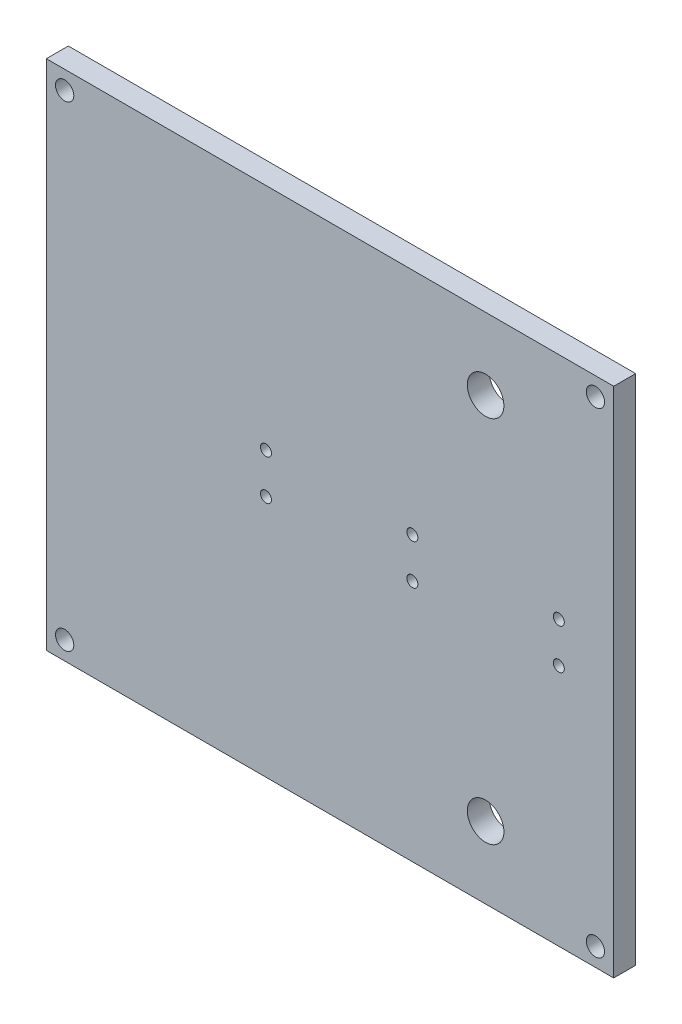
ISO-10303-21;
HEADER;
FILE_DESCRIPTION(('STEP AP214'),'2;1');
FILE_NAME('part.step','',(''),(''),'','','');
FILE_SCHEMA(('AUTOMOTIVE_DESIGN { 1 0 10303 214 1 1 1 1 }'));
ENDSEC;
DATA;
#1=APPLICATION_CONTEXT('core data for automotive mechanical design processes');
#2=APPLICATION_PROTOCOL_DEFINITION('international standard','automotive_design',2000,#1);
#3=PRODUCT_CONTEXT('',#1,'mechanical');
#4=PRODUCT('Part','Part','',(#3));
#5=PRODUCT_RELATED_PRODUCT_CATEGORY('part','',(#4));
#6=PRODUCT_DEFINITION_FORMATION('','',#4);
#7=PRODUCT_DEFINITION_CONTEXT('part definition',#1,'design');
#8=PRODUCT_DEFINITION('design','',#6,#7);
#9=PRODUCT_DEFINITION_SHAPE('','',#8);
#10=(LENGTH_UNIT() NAMED_UNIT(*) SI_UNIT(.MILLI.,.METRE.));
#11=(NAMED_UNIT(*) PLANE_ANGLE_UNIT() SI_UNIT($,.RADIAN.));
#12=(NAMED_UNIT(*) SI_UNIT($,.STERADIAN.) SOLID_ANGLE_UNIT());
#13=UNCERTAINTY_MEASURE_WITH_UNIT(LENGTH_MEASURE(1.E-05),#10,'distance_accuracy_value','');
#14=(GEOMETRIC_REPRESENTATION_CONTEXT(3) GLOBAL_UNCERTAINTY_ASSIGNED_CONTEXT((#13)) GLOBAL_UNIT_ASSIGNED_CONTEXT((#10,
#11,#12)) REPRESENTATION_CONTEXT('',''));
#15=CARTESIAN_POINT('',(0.,0.,0.));
#16=DIRECTION('',(0.,0.,1.));
#17=DIRECTION('',(1.,0.,0.));
#18=AXIS2_PLACEMENT_3D('',#15,#16,#17);
#19=CARTESIAN_POINT('',(0.,0.,6.));
#20=DIRECTION('',(0.,0.,1.));
#21=DIRECTION('',(1.,0.,0.));
#22=AXIS2_PLACEMENT_3D('',#19,#20,#21);
#23=PLANE('',#22);
#24=CARTESIAN_POINT('',(-17.5,1.87499999999996,6.));
#25=DIRECTION('',(0.,0.,1.));
#26=DIRECTION('',(1.,0.,0.));
#27=AXIS2_PLACEMENT_3D('',#24,#25,#26);
#28=CIRCLE('',#27,1.5);
#29=CARTESIAN_POINT('',(-16.,1.87499999999996,6.));
#30=VERTEX_POINT('',#29);
#31=EDGE_CURVE('E178',#30,#30,#28,.T.);
#32=ORIENTED_EDGE('',*,*,#31,.F.);
#33=EDGE_LOOP('',(#32));
#34=FACE_BOUND('',#33,.T.);
#35=CARTESIAN_POINT('',(22.5,1.87499999999996,6.));
#36=DIRECTION('',(0.,0.,1.));
#37=DIRECTION('',(1.,0.,0.));
#38=AXIS2_PLACEMENT_3D('',#35,#36,#37);
#39=CIRCLE('',#38,1.5);
#40=CARTESIAN_POINT('',(24.,1.87499999999996,6.));
#41=VERTEX_POINT('',#40);
#42=EDGE_CURVE('E172',#41,#41,#39,.T.);
#43=ORIENTED_EDGE('',*,*,#42,.F.);
#44=EDGE_LOOP('',(#43));
#45=FACE_BOUND('',#44,.T.);
#46=CARTESIAN_POINT('',(62.5,1.87499999999996,6.));
#47=DIRECTION('',(0.,0.,1.));
#48=DIRECTION('',(1.,0.,0.));
#49=AXIS2_PLACEMENT_3D('',#46,#47,#48);
#50=CIRCLE('',#49,1.5);
#51=CARTESIAN_POINT('',(64.,1.87499999999996,6.));
#52=VERTEX_POINT('',#51);
#53=EDGE_CURVE('E166',#52,#52,#50,.T.);
#54=ORIENTED_EDGE('',*,*,#53,.F.);
#55=EDGE_LOOP('',(#54));
#56=FACE_BOUND('',#55,.T.);
#57=CARTESIAN_POINT('',(62.5,12.875,6.));
#58=DIRECTION('',(0.,0.,1.));
#59=DIRECTION('',(1.,0.,0.));
#60=AXIS2_PLACEMENT_3D('',#57,#58,#59);
#61=CIRCLE('',#60,1.5);
#62=CARTESIAN_POINT('',(64.,12.875,6.));
#63=VERTEX_POINT('',#62);
#64=EDGE_CURVE('E160',#63,#63,#61,.T.);
#65=ORIENTED_EDGE('',*,*,#64,.F.);
#66=EDGE_LOOP('',(#65));
#67=FACE_BOUND('',#66,.T.);
#68=CARTESIAN_POINT('',(22.5,12.875,6.));
#69=DIRECTION('',(0.,0.,1.));
#70=DIRECTION('',(1.,0.,0.));
#71=AXIS2_PLACEMENT_3D('',#68,#69,#70);
#72=CIRCLE('',#71,1.5);
#73=CARTESIAN_POINT('',(24.,12.875,6.));
#74=VERTEX_POINT('',#73);
#75=EDGE_CURVE('E154',#74,#74,#72,.T.);
#76=ORIENTED_EDGE('',*,*,#75,.F.);
#77=EDGE_LOOP('',(#76));
#78=FACE_BOUND('',#77,.T.);
#79=CARTESIAN_POINT('',(-17.5,12.875,6.));
#80=DIRECTION('',(0.,0.,1.));
#81=DIRECTION('',(1.,0.,0.));
#82=AXIS2_PLACEMENT_3D('',#79,#80,#81);
#83=CIRCLE('',#82,1.5);
#84=CARTESIAN_POINT('',(-16.,12.875,6.));
#85=VERTEX_POINT('',#84);
#86=EDGE_CURVE('E148',#85,#85,#83,.T.);
#87=ORIENTED_EDGE('',*,*,#86,.F.);
#88=EDGE_LOOP('',(#87));
#89=FACE_BOUND('',#88,.T.);
#90=CARTESIAN_POINT('',(72.5,-59.5,6.));
#91=DIRECTION('',(0.,0.,1.));
#92=DIRECTION('',(-1.,0.,0.));
#93=AXIS2_PLACEMENT_3D('',#90,#91,#92);
#94=CIRCLE('',#93,2.50000000000001);
#95=CARTESIAN_POINT('',(70.,-59.5,6.));
#96=VERTEX_POINT('',#95);
#97=EDGE_CURVE('E133',#96,#96,#94,.T.);
#98=ORIENTED_EDGE('',*,*,#97,.F.);
#99=EDGE_LOOP('',(#98));
#100=FACE_BOUND('',#99,.T.);
#101=CARTESIAN_POINT('',(-72.5,-59.5,6.));
#102=DIRECTION('',(0.,0.,1.));
#103=DIRECTION('',(1.,0.,0.));
#104=AXIS2_PLACEMENT_3D('',#101,#102,#103);
#105=CIRCLE('',#104,2.50000000000001);
#106=CARTESIAN_POINT('',(-70.,-59.5,6.));
#107=VERTEX_POINT('',#106);
#108=EDGE_CURVE('E121',#107,#107,#105,.T.);
#109=ORIENTED_EDGE('',*,*,#108,.F.);
#110=EDGE_LOOP('',(#109));
#111=FACE_BOUND('',#110,.T.);
#112=CARTESIAN_POINT('',(42.5,-44.9,6.));
#113=DIRECTION('',(0.,0.,1.));
#114=DIRECTION('',(1.,0.,0.));
#115=AXIS2_PLACEMENT_3D('',#112,#113,#114);
#116=CIRCLE('',#115,5.);
#117=CARTESIAN_POINT('',(47.5,-44.9,6.));
#118=VERTEX_POINT('',#117);
#119=EDGE_CURVE('E100',#118,#118,#116,.T.);
#120=ORIENTED_EDGE('',*,*,#119,.F.);
#121=EDGE_LOOP('',(#120));
#122=FACE_BOUND('',#121,.T.);
#123=DIRECTION('',(0.,-1.,0.));
#124=VECTOR('',#123,1.);
#125=CARTESIAN_POINT('',(-77.5,75.5,6.));
#126=LINE('',#125,#124);
#127=CARTESIAN_POINT('',(-77.5,75.5,6.));
#128=VERTEX_POINT('',#127);
#129=CARTESIAN_POINT('',(-77.5,-64.5,6.));
#130=VERTEX_POINT('',#129);
#131=EDGE_CURVE('E85',#128,#130,#126,.T.);
#132=ORIENTED_EDGE('',*,*,#131,.T.);
#133=DIRECTION('',(1.,0.,0.));
#134=VECTOR('',#133,1.);
#135=CARTESIAN_POINT('',(-77.5,-64.5,6.));
#136=LINE('',#135,#134);
#137=CARTESIAN_POINT('',(77.5,-64.5000000000001,6.));
#138=VERTEX_POINT('',#137);
#139=EDGE_CURVE('E80',#130,#138,#136,.T.);
#140=ORIENTED_EDGE('',*,*,#139,.T.);
#141=DIRECTION('',(0.,1.,0.));
#142=VECTOR('',#141,1.);
#143=CARTESIAN_POINT('',(77.5,75.5,6.));
#144=LINE('',#143,#142);
#145=CARTESIAN_POINT('',(77.5,75.5,6.));
#146=VERTEX_POINT('',#145);
#147=EDGE_CURVE('E83',#138,#146,#144,.T.);
#148=ORIENTED_EDGE('',*,*,#147,.T.);
#149=DIRECTION('',(-1.,0.,0.));
#150=VECTOR('',#149,1.);
#151=CARTESIAN_POINT('',(-77.5,75.5,6.));
#152=LINE('',#151,#150);
#153=EDGE_CURVE('E50',#146,#128,#152,.T.);
#154=ORIENTED_EDGE('',*,*,#153,.T.);
#155=EDGE_LOOP('',(#132,#140,#148,#154));
#156=FACE_BOUND('',#155,.T.);
#157=CARTESIAN_POINT('',(42.5,55.875,6.));
#158=DIRECTION('',(0.,0.,1.));
#159=DIRECTION('',(-1.,0.,0.));
#160=AXIS2_PLACEMENT_3D('',#157,#158,#159);
#161=CIRCLE('',#160,4.99999999999999);
#162=CARTESIAN_POINT('',(37.5,55.875,6.));
#163=VERTEX_POINT('',#162);
#164=EDGE_CURVE('E115',#163,#163,#161,.T.);
#165=ORIENTED_EDGE('',*,*,#164,.F.);
#166=EDGE_LOOP('',(#165));
#167=FACE_BOUND('',#166,.T.);
#168=CARTESIAN_POINT('',(-72.5,70.5,6.));
#169=DIRECTION('',(0.,0.,1.));
#170=DIRECTION('',(-1.,0.,0.));
#171=AXIS2_PLACEMENT_3D('',#168,#169,#170);
#172=CIRCLE('',#171,2.50000000000001);
#173=CARTESIAN_POINT('',(-75.,70.5,6.));
#174=VERTEX_POINT('',#173);
#175=EDGE_CURVE('E127',#174,#174,#172,.T.);
#176=ORIENTED_EDGE('',*,*,#175,.F.);
#177=EDGE_LOOP('',(#176));
#178=FACE_BOUND('',#177,.T.);
#179=CARTESIAN_POINT('',(72.5,70.5,6.));
#180=DIRECTION('',(0.,0.,1.));
#181=DIRECTION('',(1.,0.,0.));
#182=AXIS2_PLACEMENT_3D('',#179,#180,#181);
#183=CIRCLE('',#182,2.50000000000001);
#184=CARTESIAN_POINT('',(75.,70.5,6.));
#185=VERTEX_POINT('',#184);
#186=EDGE_CURVE('E139',#185,#185,#183,.T.);
#187=ORIENTED_EDGE('',*,*,#186,.F.);
#188=EDGE_LOOP('',(#187));
#189=FACE_BOUND('',#188,.T.);
#190=ADVANCED_FACE('F33',(#34,#45,#56,#67,#78,#89,#100,#111,#122,#156,#167,#178,#189),#23,.T.);
#191=CARTESIAN_POINT('',(0.,0.,0.));
#192=DIRECTION('',(0.,0.,1.));
#193=DIRECTION('',(1.,0.,0.));
#194=AXIS2_PLACEMENT_3D('',#191,#192,#193);
#195=PLANE('',#194);
#196=CARTESIAN_POINT('',(-17.5,1.87499999999996,0.));
#197=DIRECTION('',(0.,0.,1.));
#198=DIRECTION('',(1.,0.,0.));
#199=AXIS2_PLACEMENT_3D('',#196,#197,#198);
#200=CIRCLE('',#199,1.5);
#201=CARTESIAN_POINT('',(-16.,1.87499999999996,0.));
#202=VERTEX_POINT('',#201);
#203=EDGE_CURVE('E175',#202,#202,#200,.T.);
#204=ORIENTED_EDGE('',*,*,#203,.T.);
#205=EDGE_LOOP('',(#204));
#206=FACE_BOUND('',#205,.T.);
#207=CARTESIAN_POINT('',(22.5,1.87499999999996,0.));
#208=DIRECTION('',(0.,0.,1.));
#209=DIRECTION('',(1.,0.,0.));
#210=AXIS2_PLACEMENT_3D('',#207,#208,#209);
#211=CIRCLE('',#210,1.5);
#212=CARTESIAN_POINT('',(24.,1.87499999999996,0.));
#213=VERTEX_POINT('',#212);
#214=EDGE_CURVE('E169',#213,#213,#211,.T.);
#215=ORIENTED_EDGE('',*,*,#214,.T.);
#216=EDGE_LOOP('',(#215));
#217=FACE_BOUND('',#216,.T.);
#218=CARTESIAN_POINT('',(62.5,1.87499999999996,0.));
#219=DIRECTION('',(0.,0.,1.));
#220=DIRECTION('',(1.,0.,0.));
#221=AXIS2_PLACEMENT_3D('',#218,#219,#220);
#222=CIRCLE('',#221,1.5);
#223=CARTESIAN_POINT('',(64.,1.87499999999996,0.));
#224=VERTEX_POINT('',#223);
#225=EDGE_CURVE('E163',#224,#224,#222,.T.);
#226=ORIENTED_EDGE('',*,*,#225,.T.);
#227=EDGE_LOOP('',(#226));
#228=FACE_BOUND('',#227,.T.);
#229=CARTESIAN_POINT('',(62.5,12.875,0.));
#230=DIRECTION('',(0.,0.,1.));
#231=DIRECTION('',(1.,0.,0.));
#232=AXIS2_PLACEMENT_3D('',#229,#230,#231);
#233=CIRCLE('',#232,1.5);
#234=CARTESIAN_POINT('',(64.,12.875,0.));
#235=VERTEX_POINT('',#234);
#236=EDGE_CURVE('E157',#235,#235,#233,.T.);
#237=ORIENTED_EDGE('',*,*,#236,.T.);
#238=EDGE_LOOP('',(#237));
#239=FACE_BOUND('',#238,.T.);
#240=CARTESIAN_POINT('',(22.5,12.875,0.));
#241=DIRECTION('',(0.,0.,1.));
#242=DIRECTION('',(1.,0.,0.));
#243=AXIS2_PLACEMENT_3D('',#240,#241,#242);
#244=CIRCLE('',#243,1.5);
#245=CARTESIAN_POINT('',(24.,12.875,0.));
#246=VERTEX_POINT('',#245);
#247=EDGE_CURVE('E151',#246,#246,#244,.T.);
#248=ORIENTED_EDGE('',*,*,#247,.T.);
#249=EDGE_LOOP('',(#248));
#250=FACE_BOUND('',#249,.T.);
#251=CARTESIAN_POINT('',(-17.5,12.875,0.));
#252=DIRECTION('',(0.,0.,1.));
#253=DIRECTION('',(1.,0.,0.));
#254=AXIS2_PLACEMENT_3D('',#251,#252,#253);
#255=CIRCLE('',#254,1.5);
#256=CARTESIAN_POINT('',(-16.,12.875,0.));
#257=VERTEX_POINT('',#256);
#258=EDGE_CURVE('E145',#257,#257,#255,.T.);
#259=ORIENTED_EDGE('',*,*,#258,.T.);
#260=EDGE_LOOP('',(#259));
#261=FACE_BOUND('',#260,.T.);
#262=DIRECTION('',(0.,-1.,0.));
#263=VECTOR('',#262,1.);
#264=CARTESIAN_POINT('',(-77.5,75.5,0.));
#265=LINE('',#264,#263);
#266=CARTESIAN_POINT('',(-77.5,75.5,0.));
#267=VERTEX_POINT('',#266);
#268=CARTESIAN_POINT('',(-77.5,-64.5,0.));
#269=VERTEX_POINT('',#268);
#270=EDGE_CURVE('E97',#267,#269,#265,.T.);
#271=ORIENTED_EDGE('',*,*,#270,.F.);
#272=DIRECTION('',(-1.,0.,0.));
#273=VECTOR('',#272,1.);
#274=CARTESIAN_POINT('',(-77.5,75.5,0.));
#275=LINE('',#274,#273);
#276=CARTESIAN_POINT('',(77.5,75.5,0.));
#277=VERTEX_POINT('',#276);
#278=EDGE_CURVE('E73',#277,#267,#275,.T.);
#279=ORIENTED_EDGE('',*,*,#278,.F.);
#280=DIRECTION('',(0.,1.,0.));
#281=VECTOR('',#280,1.);
#282=CARTESIAN_POINT('',(77.5,75.5,0.));
#283=LINE('',#282,#281);
#284=CARTESIAN_POINT('',(77.5,-64.5000000000001,0.));
#285=VERTEX_POINT('',#284);
#286=EDGE_CURVE('E67',#285,#277,#283,.T.);
#287=ORIENTED_EDGE('',*,*,#286,.F.);
#288=DIRECTION('',(1.,0.,0.));
#289=VECTOR('',#288,1.);
#290=CARTESIAN_POINT('',(-77.5,-64.5,0.));
#291=LINE('',#290,#289);
#292=EDGE_CURVE('E89',#269,#285,#291,.T.);
#293=ORIENTED_EDGE('',*,*,#292,.F.);
#294=EDGE_LOOP('',(#271,#279,#287,#293));
#295=FACE_BOUND('',#294,.T.);
#296=CARTESIAN_POINT('',(42.5,-44.9,0.));
#297=DIRECTION('',(0.,0.,1.));
#298=DIRECTION('',(1.,0.,0.));
#299=AXIS2_PLACEMENT_3D('',#296,#297,#298);
#300=CIRCLE('',#299,5.);
#301=CARTESIAN_POINT('',(47.5,-44.9,0.));
#302=VERTEX_POINT('',#301);
#303=EDGE_CURVE('E112',#302,#302,#300,.T.);
#304=ORIENTED_EDGE('',*,*,#303,.T.);
#305=EDGE_LOOP('',(#304));
#306=FACE_BOUND('',#305,.T.);
#307=CARTESIAN_POINT('',(42.5,55.875,0.));
#308=DIRECTION('',(0.,0.,1.));
#309=DIRECTION('',(-1.,0.,0.));
#310=AXIS2_PLACEMENT_3D('',#307,#308,#309);
#311=CIRCLE('',#310,4.99999999999999);
#312=CARTESIAN_POINT('',(37.5,55.875,0.));
#313=VERTEX_POINT('',#312);
#314=EDGE_CURVE('E118',#313,#313,#311,.T.);
#315=ORIENTED_EDGE('',*,*,#314,.T.);
#316=EDGE_LOOP('',(#315));
#317=FACE_BOUND('',#316,.T.);
#318=CARTESIAN_POINT('',(-72.5,-59.5,0.));
#319=DIRECTION('',(0.,0.,1.));
#320=DIRECTION('',(1.,0.,0.));
#321=AXIS2_PLACEMENT_3D('',#318,#319,#320);
#322=CIRCLE('',#321,2.50000000000001);
#323=CARTESIAN_POINT('',(-70.,-59.5,0.));
#324=VERTEX_POINT('',#323);
#325=EDGE_CURVE('E124',#324,#324,#322,.T.);
#326=ORIENTED_EDGE('',*,*,#325,.T.);
#327=EDGE_LOOP('',(#326));
#328=FACE_BOUND('',#327,.T.);
#329=CARTESIAN_POINT('',(-72.5,70.5,0.));
#330=DIRECTION('',(0.,0.,1.));
#331=DIRECTION('',(-1.,0.,0.));
#332=AXIS2_PLACEMENT_3D('',#329,#330,#331);
#333=CIRCLE('',#332,2.50000000000001);
#334=CARTESIAN_POINT('',(-75.,70.5,0.));
#335=VERTEX_POINT('',#334);
#336=EDGE_CURVE('E130',#335,#335,#333,.T.);
#337=ORIENTED_EDGE('',*,*,#336,.T.);
#338=EDGE_LOOP('',(#337));
#339=FACE_BOUND('',#338,.T.);
#340=CARTESIAN_POINT('',(72.5,-59.5,0.));
#341=DIRECTION('',(0.,0.,1.));
#342=DIRECTION('',(-1.,0.,0.));
#343=AXIS2_PLACEMENT_3D('',#340,#341,#342);
#344=CIRCLE('',#343,2.50000000000001);
#345=CARTESIAN_POINT('',(70.,-59.5,0.));
#346=VERTEX_POINT('',#345);
#347=EDGE_CURVE('E136',#346,#346,#344,.T.);
#348=ORIENTED_EDGE('',*,*,#347,.T.);
#349=EDGE_LOOP('',(#348));
#350=FACE_BOUND('',#349,.T.);
#351=CARTESIAN_POINT('',(72.5,70.5,0.));
#352=DIRECTION('',(0.,0.,1.));
#353=DIRECTION('',(1.,0.,0.));
#354=AXIS2_PLACEMENT_3D('',#351,#352,#353);
#355=CIRCLE('',#354,2.50000000000001);
#356=CARTESIAN_POINT('',(75.,70.5,0.));
#357=VERTEX_POINT('',#356);
#358=EDGE_CURVE('E142',#357,#357,#355,.T.);
#359=ORIENTED_EDGE('',*,*,#358,.T.);
#360=EDGE_LOOP('',(#359));
#361=FACE_BOUND('',#360,.T.);
#362=ADVANCED_FACE('F108',(#206,#217,#228,#239,#250,#261,#295,#306,#317,#328,#339,#350,#361),
#195,.F.);
#363=CARTESIAN_POINT('',(-77.5,75.5,6.));
#364=DIRECTION('',(1.,0.,0.));
#365=DIRECTION('',(0.,0.,-1.));
#366=AXIS2_PLACEMENT_3D('',#363,#364,#365);
#367=PLANE('',#366);
#368=ORIENTED_EDGE('',*,*,#270,.T.);
#369=DIRECTION('',(0.,0.,-1.));
#370=VECTOR('',#369,1.);
#371=CARTESIAN_POINT('',(-77.5,-64.5,6.));
#372=LINE('',#371,#370);
#373=EDGE_CURVE('E11',#130,#269,#372,.T.);
#374=ORIENTED_EDGE('',*,*,#373,.F.);
#375=ORIENTED_EDGE('',*,*,#131,.F.);
#376=DIRECTION('',(0.,0.,-1.));
#377=VECTOR('',#376,1.);
#378=CARTESIAN_POINT('',(-77.5,75.5,6.));
#379=LINE('',#378,#377);
#380=EDGE_CURVE('E93',#128,#267,#379,.T.);
#381=ORIENTED_EDGE('',*,*,#380,.T.);
#382=EDGE_LOOP('',(#368,#374,#375,#381));
#383=FACE_BOUND('',#382,.T.);
#384=ADVANCED_FACE('F35',(#383),#367,.F.);
#385=CARTESIAN_POINT('',(-77.5,-64.5,6.));
#386=DIRECTION('',(0.,1.,0.));
#387=DIRECTION('',(-1.,0.,0.));
#388=AXIS2_PLACEMENT_3D('',#385,#386,#387);
#389=PLANE('',#388);
#390=ORIENTED_EDGE('',*,*,#292,.T.);
#391=DIRECTION('',(0.,0.,-1.));
#392=VECTOR('',#391,1.);
#393=CARTESIAN_POINT('',(77.5,-64.5000000000001,6.));
#394=LINE('',#393,#392);
#395=EDGE_CURVE('E42',#138,#285,#394,.T.);
#396=ORIENTED_EDGE('',*,*,#395,.F.);
#397=ORIENTED_EDGE('',*,*,#139,.F.);
#398=ORIENTED_EDGE('',*,*,#373,.T.);
#399=EDGE_LOOP('',(#390,#396,#397,#398));
#400=FACE_BOUND('',#399,.T.);
#401=ADVANCED_FACE('F88',(#400),#389,.F.);
#402=CARTESIAN_POINT('',(77.5,75.5,6.));
#403=DIRECTION('',(-1.,0.,0.));
#404=DIRECTION('',(0.,-1.,0.));
#405=AXIS2_PLACEMENT_3D('',#402,#403,#404);
#406=PLANE('',#405);
#407=ORIENTED_EDGE('',*,*,#286,.T.);
#408=DIRECTION('',(0.,0.,-1.));
#409=VECTOR('',#408,1.);
#410=CARTESIAN_POINT('',(77.5,75.5,6.));
#411=LINE('',#410,#409);
#412=EDGE_CURVE('E90',#146,#277,#411,.T.);
#413=ORIENTED_EDGE('',*,*,#412,.F.);
#414=ORIENTED_EDGE('',*,*,#147,.F.);
#415=ORIENTED_EDGE('',*,*,#395,.T.);
#416=EDGE_LOOP('',(#407,#413,#414,#415));
#417=FACE_BOUND('',#416,.T.);
#418=ADVANCED_FACE('F91',(#417),#406,.F.);
#419=CARTESIAN_POINT('',(-77.5,75.5,6.));
#420=DIRECTION('',(0.,-1.,0.));
#421=DIRECTION('',(0.,0.,-1.));
#422=AXIS2_PLACEMENT_3D('',#419,#420,#421);
#423=PLANE('',#422);
#424=ORIENTED_EDGE('',*,*,#278,.T.);
#425=ORIENTED_EDGE('',*,*,#380,.F.);
#426=ORIENTED_EDGE('',*,*,#153,.F.);
#427=ORIENTED_EDGE('',*,*,#412,.T.);
#428=EDGE_LOOP('',(#424,#425,#426,#427));
#429=FACE_BOUND('',#428,.T.);
#430=ADVANCED_FACE('F105',(#429),#423,.F.);
#431=CARTESIAN_POINT('',(42.5,-44.9,6.));
#432=DIRECTION('',(0.,0.,-1.));
#433=DIRECTION('',(-1.,0.,0.));
#434=AXIS2_PLACEMENT_3D('',#431,#432,#433);
#435=CYLINDRICAL_SURFACE('',#434,5.);
#436=ORIENTED_EDGE('',*,*,#119,.T.);
#437=EDGE_LOOP('',(#436));
#438=FACE_BOUND('',#437,.T.);
#439=ORIENTED_EDGE('',*,*,#303,.F.);
#440=EDGE_LOOP('',(#439));
#441=FACE_BOUND('',#440,.T.);
#442=ADVANCED_FACE('F212',(#438,#441),#435,.F.);
#443=CARTESIAN_POINT('',(42.5,55.875,6.));
#444=DIRECTION('',(0.,0.,-1.));
#445=DIRECTION('',(-1.,0.,0.));
#446=AXIS2_PLACEMENT_3D('',#443,#444,#445);
#447=CYLINDRICAL_SURFACE('',#446,4.99999999999999);
#448=ORIENTED_EDGE('',*,*,#164,.T.);
#449=EDGE_LOOP('',(#448));
#450=FACE_BOUND('',#449,.T.);
#451=ORIENTED_EDGE('',*,*,#314,.F.);
#452=EDGE_LOOP('',(#451));
#453=FACE_BOUND('',#452,.T.);
#454=ADVANCED_FACE('F215',(#450,#453),#447,.F.);
#455=CARTESIAN_POINT('',(-72.5,-59.5,6.));
#456=DIRECTION('',(0.,0.,-1.));
#457=DIRECTION('',(-1.,0.,0.));
#458=AXIS2_PLACEMENT_3D('',#455,#456,#457);
#459=CYLINDRICAL_SURFACE('',#458,2.50000000000001);
#460=ORIENTED_EDGE('',*,*,#108,.T.);
#461=EDGE_LOOP('',(#460));
#462=FACE_BOUND('',#461,.T.);
#463=ORIENTED_EDGE('',*,*,#325,.F.);
#464=EDGE_LOOP('',(#463));
#465=FACE_BOUND('',#464,.T.);
#466=ADVANCED_FACE('F251',(#462,#465),#459,.F.);
#467=CARTESIAN_POINT('',(-72.5,70.5,6.));
#468=DIRECTION('',(0.,0.,-1.));
#469=DIRECTION('',(-1.,0.,0.));
#470=AXIS2_PLACEMENT_3D('',#467,#468,#469);
#471=CYLINDRICAL_SURFACE('',#470,2.50000000000001);
#472=ORIENTED_EDGE('',*,*,#175,.T.);
#473=EDGE_LOOP('',(#472));
#474=FACE_BOUND('',#473,.T.);
#475=ORIENTED_EDGE('',*,*,#336,.F.);
#476=EDGE_LOOP('',(#475));
#477=FACE_BOUND('',#476,.T.);
#478=ADVANCED_FACE('F244',(#474,#477),#471,.F.);
#479=CARTESIAN_POINT('',(72.5,-59.5,6.));
#480=DIRECTION('',(0.,0.,-1.));
#481=DIRECTION('',(-1.,0.,0.));
#482=AXIS2_PLACEMENT_3D('',#479,#480,#481);
#483=CYLINDRICAL_SURFACE('',#482,2.50000000000001);
#484=ORIENTED_EDGE('',*,*,#97,.T.);
#485=EDGE_LOOP('',(#484));
#486=FACE_BOUND('',#485,.T.);
#487=ORIENTED_EDGE('',*,*,#347,.F.);
#488=EDGE_LOOP('',(#487));
#489=FACE_BOUND('',#488,.T.);
#490=ADVANCED_FACE('F234',(#486,#489),#483,.F.);
#491=CARTESIAN_POINT('',(72.5,70.5,6.));
#492=DIRECTION('',(0.,0.,-1.));
#493=DIRECTION('',(-1.,0.,0.));
#494=AXIS2_PLACEMENT_3D('',#491,#492,#493);
#495=CYLINDRICAL_SURFACE('',#494,2.50000000000001);
#496=ORIENTED_EDGE('',*,*,#186,.T.);
#497=EDGE_LOOP('',(#496));
#498=FACE_BOUND('',#497,.T.);
#499=ORIENTED_EDGE('',*,*,#358,.F.);
#500=EDGE_LOOP('',(#499));
#501=FACE_BOUND('',#500,.T.);
#502=ADVANCED_FACE('F231',(#498,#501),#495,.F.);
#503=CARTESIAN_POINT('',(-17.5,12.875,0.));
#504=DIRECTION('',(0.,0.,1.));
#505=DIRECTION('',(1.,0.,0.));
#506=AXIS2_PLACEMENT_3D('',#503,#504,#505);
#507=CYLINDRICAL_SURFACE('',#506,1.5);
#508=ORIENTED_EDGE('',*,*,#258,.F.);
#509=EDGE_LOOP('',(#508));
#510=FACE_BOUND('',#509,.T.);
#511=ORIENTED_EDGE('',*,*,#86,.T.);
#512=EDGE_LOOP('',(#511));
#513=FACE_BOUND('',#512,.T.);
#514=ADVANCED_FACE('F233',(#510,#513),#507,.F.);
#515=CARTESIAN_POINT('',(22.5,12.875,0.));
#516=DIRECTION('',(0.,0.,1.));
#517=DIRECTION('',(1.,0.,0.));
#518=AXIS2_PLACEMENT_3D('',#515,#516,#517);
#519=CYLINDRICAL_SURFACE('',#518,1.5);
#520=ORIENTED_EDGE('',*,*,#247,.F.);
#521=EDGE_LOOP('',(#520));
#522=FACE_BOUND('',#521,.T.);
#523=ORIENTED_EDGE('',*,*,#75,.T.);
#524=EDGE_LOOP('',(#523));
#525=FACE_BOUND('',#524,.T.);
#526=ADVANCED_FACE('F241',(#522,#525),#519,.F.);
#527=CARTESIAN_POINT('',(62.5,12.875,0.));
#528=DIRECTION('',(0.,0.,1.));
#529=DIRECTION('',(1.,0.,0.));
#530=AXIS2_PLACEMENT_3D('',#527,#528,#529);
#531=CYLINDRICAL_SURFACE('',#530,1.5);
#532=ORIENTED_EDGE('',*,*,#236,.F.);
#533=EDGE_LOOP('',(#532));
#534=FACE_BOUND('',#533,.T.);
#535=ORIENTED_EDGE('',*,*,#64,.T.);
#536=EDGE_LOOP('',(#535));
#537=FACE_BOUND('',#536,.T.);
#538=ADVANCED_FACE('F345',(#534,#537),#531,.F.);
#539=CARTESIAN_POINT('',(62.5,1.87499999999996,0.));
#540=DIRECTION('',(0.,0.,1.));
#541=DIRECTION('',(1.,0.,0.));
#542=AXIS2_PLACEMENT_3D('',#539,#540,#541);
#543=CYLINDRICAL_SURFACE('',#542,1.5);
#544=ORIENTED_EDGE('',*,*,#225,.F.);
#545=EDGE_LOOP('',(#544));
#546=FACE_BOUND('',#545,.T.);
#547=ORIENTED_EDGE('',*,*,#53,.T.);
#548=EDGE_LOOP('',(#547));
#549=FACE_BOUND('',#548,.T.);
#550=ADVANCED_FACE('F353',(#546,#549),#543,.F.);
#551=CARTESIAN_POINT('',(22.5,1.87499999999996,0.));
#552=DIRECTION('',(0.,0.,1.));
#553=DIRECTION('',(1.,0.,0.));
#554=AXIS2_PLACEMENT_3D('',#551,#552,#553);
#555=CYLINDRICAL_SURFACE('',#554,1.5);
#556=ORIENTED_EDGE('',*,*,#214,.F.);
#557=EDGE_LOOP('',(#556));
#558=FACE_BOUND('',#557,.T.);
#559=ORIENTED_EDGE('',*,*,#42,.T.);
#560=EDGE_LOOP('',(#559));
#561=FACE_BOUND('',#560,.T.);
#562=ADVANCED_FACE('F189',(#558,#561),#555,.F.);
#563=CARTESIAN_POINT('',(-17.5,1.87499999999996,0.));
#564=DIRECTION('',(0.,0.,1.));
#565=DIRECTION('',(1.,0.,0.));
#566=AXIS2_PLACEMENT_3D('',#563,#564,#565);
#567=CYLINDRICAL_SURFACE('',#566,1.5);
#568=ORIENTED_EDGE('',*,*,#203,.F.);
#569=EDGE_LOOP('',(#568));
#570=FACE_BOUND('',#569,.T.);
#571=ORIENTED_EDGE('',*,*,#31,.T.);
#572=EDGE_LOOP('',(#571));
#573=FACE_BOUND('',#572,.T.);
#574=ADVANCED_FACE('F186',(#570,#573),#567,.F.);
#575=CLOSED_SHELL('',(#190,#362,#384,#401,#418,#430,#442,#454,#466,#478,#490,#502,#514,#526,
#538,#550,#562,#574));
#576=MANIFOLD_SOLID_BREP('B2',#575);
#577=ADVANCED_BREP_SHAPE_REPRESENTATION('',(#18,#576),#14);
#578=SHAPE_DEFINITION_REPRESENTATION(#9,#577);
ENDSEC;
END-ISO-10303-21;
